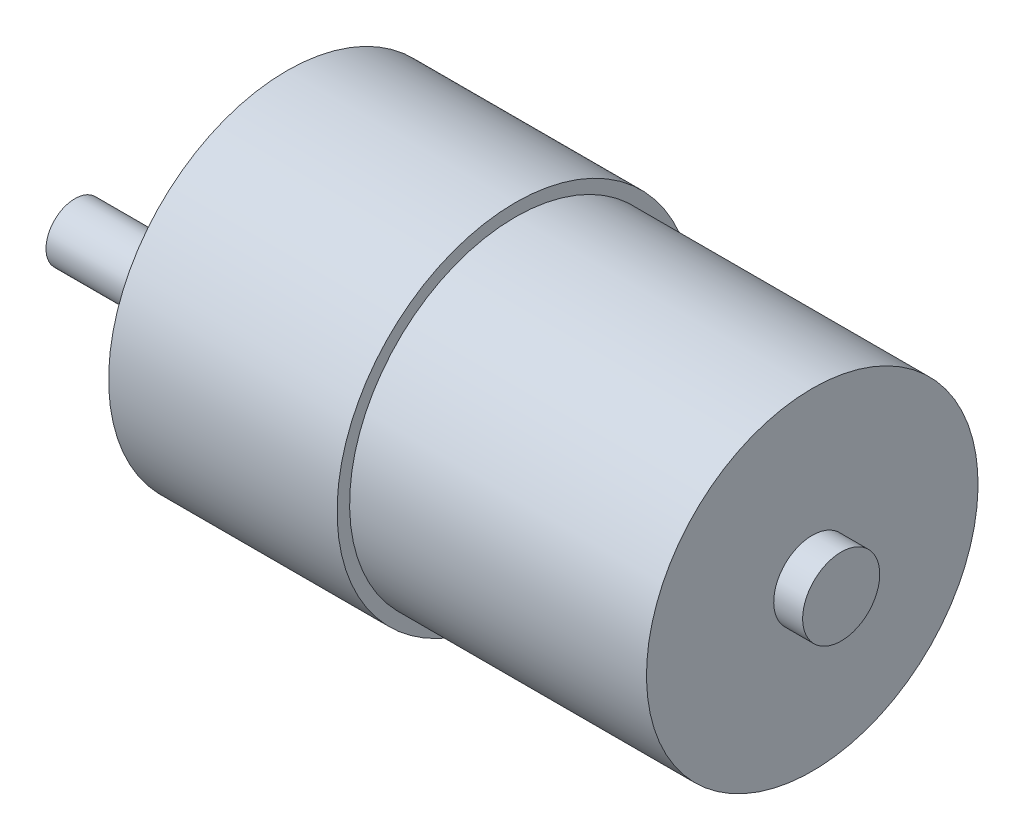
ISO-10303-21;
HEADER;
FILE_DESCRIPTION(('STEP AP214'),'2;1');
FILE_NAME('part.step','',(''),(''),'','','');
FILE_SCHEMA(('AUTOMOTIVE_DESIGN { 1 0 10303 214 1 1 1 1 }'));
ENDSEC;
DATA;
#1=APPLICATION_CONTEXT('core data for automotive mechanical design processes');
#2=APPLICATION_PROTOCOL_DEFINITION('international standard','automotive_design',2000,#1);
#3=PRODUCT_CONTEXT('',#1,'mechanical');
#4=PRODUCT('Part','Part','',(#3));
#5=PRODUCT_RELATED_PRODUCT_CATEGORY('part','',(#4));
#6=PRODUCT_DEFINITION_FORMATION('','',#4);
#7=PRODUCT_DEFINITION_CONTEXT('part definition',#1,'design');
#8=PRODUCT_DEFINITION('design','',#6,#7);
#9=PRODUCT_DEFINITION_SHAPE('','',#8);
#10=(LENGTH_UNIT() NAMED_UNIT(*) SI_UNIT(.MILLI.,.METRE.));
#11=(NAMED_UNIT(*) PLANE_ANGLE_UNIT() SI_UNIT($,.RADIAN.));
#12=(NAMED_UNIT(*) SI_UNIT($,.STERADIAN.) SOLID_ANGLE_UNIT());
#13=UNCERTAINTY_MEASURE_WITH_UNIT(LENGTH_MEASURE(1.E-05),#10,'distance_accuracy_value','');
#14=(GEOMETRIC_REPRESENTATION_CONTEXT(3) GLOBAL_UNCERTAINTY_ASSIGNED_CONTEXT((#13)) GLOBAL_UNIT_ASSIGNED_CONTEXT((#10,
#11,#12)) REPRESENTATION_CONTEXT('',''));
#15=CARTESIAN_POINT('',(0.,0.,0.));
#16=DIRECTION('',(0.,0.,1.));
#17=DIRECTION('',(1.,0.,0.));
#18=AXIS2_PLACEMENT_3D('',#15,#16,#17);
#19=CARTESIAN_POINT('',(-23.7,0.,0.));
#20=DIRECTION('',(1.,0.,0.));
#21=DIRECTION('',(0.,1.,0.));
#22=AXIS2_PLACEMENT_3D('',#19,#20,#21);
#23=PLANE('',#22);
#24=CARTESIAN_POINT('',(-23.7,-7.,0.));
#25=DIRECTION('',(1.,0.,0.));
#26=DIRECTION('',(0.,-1.,0.));
#27=AXIS2_PLACEMENT_3D('',#24,#25,#26);
#28=CIRCLE('',#27,6.5);
#29=CARTESIAN_POINT('',(-23.7,-13.5,0.));
#30=VERTEX_POINT('',#29);
#31=EDGE_CURVE('E42',#30,#30,#28,.T.);
#32=ORIENTED_EDGE('',*,*,#31,.T.);
#33=EDGE_LOOP('',(#32));
#34=FACE_BOUND('',#33,.T.);
#35=CARTESIAN_POINT('',(-23.7,0.,0.));
#36=DIRECTION('',(-1.,0.,0.));
#37=DIRECTION('',(0.,1.,0.));
#38=AXIS2_PLACEMENT_3D('',#35,#36,#37);
#39=CIRCLE('',#38,18.5);
#40=CARTESIAN_POINT('',(-23.7,18.5,0.));
#41=VERTEX_POINT('',#40);
#42=EDGE_CURVE('E53',#41,#41,#39,.T.);
#43=ORIENTED_EDGE('',*,*,#42,.T.);
#44=EDGE_LOOP('',(#43));
#45=FACE_BOUND('',#44,.T.);
#46=ADVANCED_FACE('F35',(#34,#45),#23,.F.);
#47=CARTESIAN_POINT('',(33.8,0.,0.));
#48=DIRECTION('',(-1.,0.,0.));
#49=DIRECTION('',(0.,-1.,0.));
#50=AXIS2_PLACEMENT_3D('',#47,#48,#49);
#51=PLANE('',#50);
#52=CARTESIAN_POINT('',(33.8,0.,0.));
#53=DIRECTION('',(-1.,0.,0.));
#54=DIRECTION('',(0.,1.,0.));
#55=AXIS2_PLACEMENT_3D('',#52,#53,#54);
#56=CIRCLE('',#55,4.);
#57=CARTESIAN_POINT('',(33.8,4.,0.));
#58=VERTEX_POINT('',#57);
#59=EDGE_CURVE('E38',#58,#58,#56,.T.);
#60=ORIENTED_EDGE('',*,*,#59,.F.);
#61=EDGE_LOOP('',(#60));
#62=FACE_BOUND('',#61,.T.);
#63=ADVANCED_FACE('F75',(#62),#51,.F.);
#64=CARTESIAN_POINT('',(30.8,0.,0.));
#65=DIRECTION('',(1.,0.,0.));
#66=DIRECTION('',(0.,1.,0.));
#67=AXIS2_PLACEMENT_3D('',#64,#65,#66);
#68=CYLINDRICAL_SURFACE('',#67,4.);
#69=ORIENTED_EDGE('',*,*,#59,.T.);
#70=EDGE_LOOP('',(#69));
#71=FACE_BOUND('',#70,.T.);
#72=CARTESIAN_POINT('',(30.8,0.,0.));
#73=DIRECTION('',(-1.,0.,0.));
#74=DIRECTION('',(0.,1.,0.));
#75=AXIS2_PLACEMENT_3D('',#72,#73,#74);
#76=CIRCLE('',#75,4.);
#77=CARTESIAN_POINT('',(30.8,4.,0.));
#78=VERTEX_POINT('',#77);
#79=EDGE_CURVE('E65',#78,#78,#76,.T.);
#80=ORIENTED_EDGE('',*,*,#79,.F.);
#81=EDGE_LOOP('',(#80));
#82=FACE_BOUND('',#81,.T.);
#83=ADVANCED_FACE('F72',(#71,#82),#68,.T.);
#84=CARTESIAN_POINT('',(30.8,0.,0.));
#85=DIRECTION('',(-1.,0.,0.));
#86=DIRECTION('',(0.,-1.,0.));
#87=AXIS2_PLACEMENT_3D('',#84,#85,#86);
#88=PLANE('',#87);
#89=ORIENTED_EDGE('',*,*,#79,.T.);
#90=EDGE_LOOP('',(#89));
#91=FACE_BOUND('',#90,.T.);
#92=CARTESIAN_POINT('',(30.8,0.,0.));
#93=DIRECTION('',(-1.,0.,0.));
#94=DIRECTION('',(0.,1.,0.));
#95=AXIS2_PLACEMENT_3D('',#92,#93,#94);
#96=CIRCLE('',#95,17.2);
#97=CARTESIAN_POINT('',(30.8,17.2,0.));
#98=VERTEX_POINT('',#97);
#99=EDGE_CURVE('E63',#98,#98,#96,.T.);
#100=ORIENTED_EDGE('',*,*,#99,.F.);
#101=EDGE_LOOP('',(#100));
#102=FACE_BOUND('',#101,.T.);
#103=ADVANCED_FACE('F81',(#91,#102),#88,.F.);
#104=CARTESIAN_POINT('',(30.8,0.,0.));
#105=DIRECTION('',(1.,0.,0.));
#106=DIRECTION('',(0.,1.,0.));
#107=AXIS2_PLACEMENT_3D('',#104,#105,#106);
#108=CYLINDRICAL_SURFACE('',#107,17.2);
#109=ORIENTED_EDGE('',*,*,#99,.T.);
#110=EDGE_LOOP('',(#109));
#111=FACE_BOUND('',#110,.T.);
#112=CARTESIAN_POINT('',(0.,0.,0.));
#113=DIRECTION('',(-1.,0.,0.));
#114=DIRECTION('',(0.,1.,0.));
#115=AXIS2_PLACEMENT_3D('',#112,#113,#114);
#116=CIRCLE('',#115,17.2);
#117=CARTESIAN_POINT('',(0.,17.2,0.));
#118=VERTEX_POINT('',#117);
#119=EDGE_CURVE('E60',#118,#118,#116,.T.);
#120=ORIENTED_EDGE('',*,*,#119,.F.);
#121=EDGE_LOOP('',(#120));
#122=FACE_BOUND('',#121,.T.);
#123=ADVANCED_FACE('F87',(#111,#122),#108,.T.);
#124=CARTESIAN_POINT('',(0.,0.,0.));
#125=DIRECTION('',(1.,0.,0.));
#126=DIRECTION('',(0.,1.,0.));
#127=AXIS2_PLACEMENT_3D('',#124,#125,#126);
#128=PLANE('',#127);
#129=CARTESIAN_POINT('',(0.,0.,0.));
#130=DIRECTION('',(-1.,0.,0.));
#131=DIRECTION('',(0.,1.,0.));
#132=AXIS2_PLACEMENT_3D('',#129,#130,#131);
#133=CIRCLE('',#132,18.5);
#134=CARTESIAN_POINT('',(0.,18.5,0.));
#135=VERTEX_POINT('',#134);
#136=EDGE_CURVE('E57',#135,#135,#133,.T.);
#137=ORIENTED_EDGE('',*,*,#136,.F.);
#138=EDGE_LOOP('',(#137));
#139=FACE_BOUND('',#138,.T.);
#140=ORIENTED_EDGE('',*,*,#119,.T.);
#141=EDGE_LOOP('',(#140));
#142=FACE_BOUND('',#141,.T.);
#143=ADVANCED_FACE('F90',(#139,#142),#128,.T.);
#144=CARTESIAN_POINT('',(30.8,0.,0.));
#145=DIRECTION('',(1.,0.,0.));
#146=DIRECTION('',(0.,1.,0.));
#147=AXIS2_PLACEMENT_3D('',#144,#145,#146);
#148=CYLINDRICAL_SURFACE('',#147,18.5);
#149=ORIENTED_EDGE('',*,*,#42,.F.);
#150=EDGE_LOOP('',(#149));
#151=FACE_BOUND('',#150,.T.);
#152=ORIENTED_EDGE('',*,*,#136,.T.);
#153=EDGE_LOOP('',(#152));
#154=FACE_BOUND('',#153,.T.);
#155=ADVANCED_FACE('F94',(#151,#154),#148,.T.);
#156=CARTESIAN_POINT('',(-30.7,-7.,0.));
#157=DIRECTION('',(1.,0.,0.));
#158=DIRECTION('',(0.,1.,0.));
#159=AXIS2_PLACEMENT_3D('',#156,#157,#158);
#160=CYLINDRICAL_SURFACE('',#159,6.5);
#161=CARTESIAN_POINT('',(-30.7,-7.,0.));
#162=DIRECTION('',(1.,0.,0.));
#163=DIRECTION('',(0.,-1.,0.));
#164=AXIS2_PLACEMENT_3D('',#161,#162,#163);
#165=CIRCLE('',#164,6.5);
#166=CARTESIAN_POINT('',(-30.7,-13.5,0.));
#167=VERTEX_POINT('',#166);
#168=EDGE_CURVE('E51',#167,#167,#165,.T.);
#169=ORIENTED_EDGE('',*,*,#168,.T.);
#170=EDGE_LOOP('',(#169));
#171=FACE_BOUND('',#170,.T.);
#172=ORIENTED_EDGE('',*,*,#31,.F.);
#173=EDGE_LOOP('',(#172));
#174=FACE_BOUND('',#173,.T.);
#175=ADVANCED_FACE('F98',(#171,#174),#160,.T.);
#176=CARTESIAN_POINT('',(-30.7,-7.,0.));
#177=DIRECTION('',(-1.,0.,0.));
#178=DIRECTION('',(0.,-1.,0.));
#179=AXIS2_PLACEMENT_3D('',#176,#177,#178);
#180=PLANE('',#179);
#181=CARTESIAN_POINT('',(-30.7,-7.,0.));
#182=DIRECTION('',(1.,0.,0.));
#183=DIRECTION('',(0.,-1.,0.));
#184=AXIS2_PLACEMENT_3D('',#181,#182,#183);
#185=CIRCLE('',#184,3.);
#186=CARTESIAN_POINT('',(-30.7,-10.,0.));
#187=VERTEX_POINT('',#186);
#188=EDGE_CURVE('E10',#187,#187,#185,.T.);
#189=ORIENTED_EDGE('',*,*,#188,.T.);
#190=EDGE_LOOP('',(#189));
#191=FACE_BOUND('',#190,.T.);
#192=ORIENTED_EDGE('',*,*,#168,.F.);
#193=EDGE_LOOP('',(#192));
#194=FACE_BOUND('',#193,.T.);
#195=ADVANCED_FACE('F102',(#191,#194),#180,.T.);
#196=CARTESIAN_POINT('',(-45.7,-7.,0.));
#197=DIRECTION('',(1.,0.,0.));
#198=DIRECTION('',(0.,1.,0.));
#199=AXIS2_PLACEMENT_3D('',#196,#197,#198);
#200=CYLINDRICAL_SURFACE('',#199,3.);
#201=CARTESIAN_POINT('',(-45.7,-7.,0.));
#202=DIRECTION('',(1.,0.,0.));
#203=DIRECTION('',(0.,-1.,0.));
#204=AXIS2_PLACEMENT_3D('',#201,#202,#203);
#205=CIRCLE('',#204,3.);
#206=CARTESIAN_POINT('',(-45.7,-10.,0.));
#207=VERTEX_POINT('',#206);
#208=EDGE_CURVE('E50',#207,#207,#205,.T.);
#209=ORIENTED_EDGE('',*,*,#208,.T.);
#210=EDGE_LOOP('',(#209));
#211=FACE_BOUND('',#210,.T.);
#212=ORIENTED_EDGE('',*,*,#188,.F.);
#213=EDGE_LOOP('',(#212));
#214=FACE_BOUND('',#213,.T.);
#215=ADVANCED_FACE('F106',(#211,#214),#200,.T.);
#216=CARTESIAN_POINT('',(-45.7,-7.,0.));
#217=DIRECTION('',(-1.,0.,0.));
#218=DIRECTION('',(0.,-1.,0.));
#219=AXIS2_PLACEMENT_3D('',#216,#217,#218);
#220=PLANE('',#219);
#221=ORIENTED_EDGE('',*,*,#208,.F.);
#222=EDGE_LOOP('',(#221));
#223=FACE_BOUND('',#222,.T.);
#224=ADVANCED_FACE('F109',(#223),#220,.T.);
#225=CLOSED_SHELL('',(#46,#63,#83,#103,#123,#143,#155,#175,#195,#215,#224));
#226=MANIFOLD_SOLID_BREP('B2',#225);
#227=ADVANCED_BREP_SHAPE_REPRESENTATION('',(#18,#226),#14);
#228=SHAPE_DEFINITION_REPRESENTATION(#9,#227);
ENDSEC;
END-ISO-10303-21;
